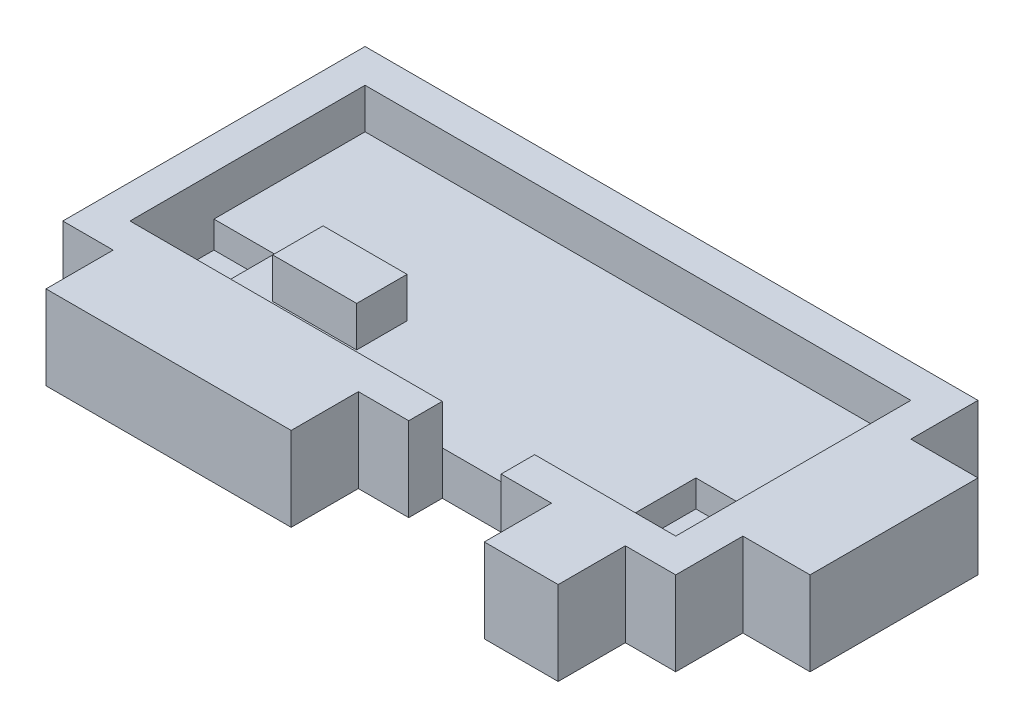
ISO-10303-21;
HEADER;
FILE_DESCRIPTION(('STEP AP214'),'2;1');
FILE_NAME('part.step','',(''),(''),'','','');
FILE_SCHEMA(('AUTOMOTIVE_DESIGN { 1 0 10303 214 1 1 1 1 }'));
ENDSEC;
DATA;
#1=APPLICATION_CONTEXT('core data for automotive mechanical design processes');
#2=APPLICATION_PROTOCOL_DEFINITION('international standard','automotive_design',2000,#1);
#3=PRODUCT_CONTEXT('',#1,'mechanical');
#4=PRODUCT('Part','Part','',(#3));
#5=PRODUCT_RELATED_PRODUCT_CATEGORY('part','',(#4));
#6=PRODUCT_DEFINITION_FORMATION('','',#4);
#7=PRODUCT_DEFINITION_CONTEXT('part definition',#1,'design');
#8=PRODUCT_DEFINITION('design','',#6,#7);
#9=PRODUCT_DEFINITION_SHAPE('','',#8);
#10=(LENGTH_UNIT() NAMED_UNIT(*) SI_UNIT(.MILLI.,.METRE.));
#11=(NAMED_UNIT(*) PLANE_ANGLE_UNIT() SI_UNIT($,.RADIAN.));
#12=(NAMED_UNIT(*) SI_UNIT($,.STERADIAN.) SOLID_ANGLE_UNIT());
#13=UNCERTAINTY_MEASURE_WITH_UNIT(LENGTH_MEASURE(1.E-05),#10,'distance_accuracy_value','');
#14=(GEOMETRIC_REPRESENTATION_CONTEXT(3) GLOBAL_UNCERTAINTY_ASSIGNED_CONTEXT((#13)) GLOBAL_UNIT_ASSIGNED_CONTEXT((#10,
#11,#12)) REPRESENTATION_CONTEXT('',''));
#15=CARTESIAN_POINT('',(0.,0.,0.));
#16=DIRECTION('',(0.,0.,1.));
#17=DIRECTION('',(1.,0.,0.));
#18=AXIS2_PLACEMENT_3D('',#15,#16,#17);
#19=CARTESIAN_POINT('',(36.5,-5.,0.));
#20=DIRECTION('',(1.,0.,0.));
#21=DIRECTION('',(0.,0.,-1.));
#22=AXIS2_PLACEMENT_3D('',#19,#20,#21);
#23=PLANE('',#22);
#24=DIRECTION('',(0.,-1.,0.));
#25=VECTOR('',#24,1.);
#26=CARTESIAN_POINT('',(36.5,0.,-4.));
#27=LINE('',#26,#25);
#28=CARTESIAN_POINT('',(36.5,0.,-4.));
#29=VERTEX_POINT('',#28);
#30=CARTESIAN_POINT('',(36.5,-5.,-4.));
#31=VERTEX_POINT('',#30);
#32=EDGE_CURVE('E297',#29,#31,#27,.T.);
#33=ORIENTED_EDGE('',*,*,#32,.F.);
#34=DIRECTION('',(0.,0.,-1.));
#35=VECTOR('',#34,1.);
#36=CARTESIAN_POINT('',(36.5,0.,0.));
#37=LINE('',#36,#35);
#38=CARTESIAN_POINT('',(36.5,0.,0.));
#39=VERTEX_POINT('',#38);
#40=EDGE_CURVE('E590',#39,#29,#37,.T.);
#41=ORIENTED_EDGE('',*,*,#40,.F.);
#42=DIRECTION('',(0.,1.,0.));
#43=VECTOR('',#42,1.);
#44=CARTESIAN_POINT('',(36.5,-5.,0.));
#45=LINE('',#44,#43);
#46=CARTESIAN_POINT('',(36.5,-5.,0.));
#47=VERTEX_POINT('',#46);
#48=EDGE_CURVE('E603',#47,#39,#45,.T.);
#49=ORIENTED_EDGE('',*,*,#48,.F.);
#50=DIRECTION('',(0.,0.,-1.));
#51=VECTOR('',#50,1.);
#52=CARTESIAN_POINT('',(36.5,-5.,0.));
#53=LINE('',#52,#51);
#54=EDGE_CURVE('E68',#47,#31,#53,.T.);
#55=ORIENTED_EDGE('',*,*,#54,.T.);
#56=EDGE_LOOP('',(#33,#41,#49,#55));
#57=FACE_BOUND('',#56,.T.);
#58=ADVANCED_FACE('F44',(#57),#23,.T.);
#59=CARTESIAN_POINT('',(0.,-5.,0.));
#60=DIRECTION('',(0.,0.,1.));
#61=DIRECTION('',(1.,0.,0.));
#62=AXIS2_PLACEMENT_3D('',#59,#60,#61);
#63=PLANE('',#62);
#64=DIRECTION('',(1.,0.,0.));
#65=VECTOR('',#64,1.);
#66=CARTESIAN_POINT('',(0.,-5.,0.));
#67=LINE('',#66,#65);
#68=CARTESIAN_POINT('',(26.1,-5.,0.));
#69=VERTEX_POINT('',#68);
#70=CARTESIAN_POINT('',(29.1,-5.,0.));
#71=VERTEX_POINT('',#70);
#72=EDGE_CURVE('E571',#69,#71,#67,.T.);
#73=ORIENTED_EDGE('',*,*,#72,.T.);
#74=DIRECTION('',(0.,-1.,0.));
#75=VECTOR('',#74,1.);
#76=CARTESIAN_POINT('',(29.1,0.,0.));
#77=LINE('',#76,#75);
#78=CARTESIAN_POINT('',(29.1,0.,0.));
#79=VERTEX_POINT('',#78);
#80=EDGE_CURVE('E322',#79,#71,#77,.T.);
#81=ORIENTED_EDGE('',*,*,#80,.F.);
#82=DIRECTION('',(1.,0.,0.));
#83=VECTOR('',#82,1.);
#84=CARTESIAN_POINT('',(0.,0.,0.));
#85=LINE('',#84,#83);
#86=CARTESIAN_POINT('',(26.1,0.,0.));
#87=VERTEX_POINT('',#86);
#88=EDGE_CURVE('E589',#87,#79,#85,.T.);
#89=ORIENTED_EDGE('',*,*,#88,.F.);
#90=DIRECTION('',(0.,-1.,0.));
#91=VECTOR('',#90,1.);
#92=CARTESIAN_POINT('',(26.1,0.,0.));
#93=LINE('',#92,#91);
#94=EDGE_CURVE('E441',#87,#69,#93,.T.);
#95=ORIENTED_EDGE('',*,*,#94,.T.);
#96=EDGE_LOOP('',(#73,#81,#89,#95));
#97=FACE_BOUND('',#96,.T.);
#98=ADVANCED_FACE('F681',(#97),#63,.T.);
#99=CARTESIAN_POINT('',(33.5,0.,0.));
#100=VERTEX_POINT('',#99);
#101=EDGE_CURVE('E582',#100,#39,#85,.T.);
#102=ORIENTED_EDGE('',*,*,#101,.F.);
#103=DIRECTION('',(0.,1.,0.));
#104=VECTOR('',#103,1.);
#105=CARTESIAN_POINT('',(33.5,0.,0.));
#106=LINE('',#105,#104);
#107=CARTESIAN_POINT('',(33.5,-5.,0.));
#108=VERTEX_POINT('',#107);
#109=EDGE_CURVE('E318',#108,#100,#106,.T.);
#110=ORIENTED_EDGE('',*,*,#109,.F.);
#111=EDGE_CURVE('E563',#108,#47,#67,.T.);
#112=ORIENTED_EDGE('',*,*,#111,.T.);
#113=ORIENTED_EDGE('',*,*,#48,.T.);
#114=EDGE_LOOP('',(#102,#110,#112,#113));
#115=FACE_BOUND('',#114,.T.);
#116=ADVANCED_FACE('F654',(#115),#63,.T.);
#117=CARTESIAN_POINT('',(0.,-5.,0.));
#118=VERTEX_POINT('',#117);
#119=CARTESIAN_POINT('',(3.,-5.,0.));
#120=VERTEX_POINT('',#119);
#121=EDGE_CURVE('E565',#118,#120,#67,.T.);
#122=ORIENTED_EDGE('',*,*,#121,.T.);
#123=DIRECTION('',(0.,-1.,0.));
#124=VECTOR('',#123,1.);
#125=CARTESIAN_POINT('',(3.,0.,0.));
#126=LINE('',#125,#124);
#127=CARTESIAN_POINT('',(3.,0.,0.));
#128=VERTEX_POINT('',#127);
#129=EDGE_CURVE('E327',#128,#120,#126,.T.);
#130=ORIENTED_EDGE('',*,*,#129,.F.);
#131=CARTESIAN_POINT('',(0.,0.,0.));
#132=VERTEX_POINT('',#131);
#133=EDGE_CURVE('E583',#132,#128,#85,.T.);
#134=ORIENTED_EDGE('',*,*,#133,.F.);
#135=DIRECTION('',(0.,1.,0.));
#136=VECTOR('',#135,1.);
#137=CARTESIAN_POINT('',(0.,-5.,0.));
#138=LINE('',#137,#136);
#139=EDGE_CURVE('E578',#118,#132,#138,.T.);
#140=ORIENTED_EDGE('',*,*,#139,.F.);
#141=EDGE_LOOP('',(#122,#130,#134,#140));
#142=FACE_BOUND('',#141,.T.);
#143=ADVANCED_FACE('F614',(#142),#63,.T.);
#144=CARTESIAN_POINT('',(17.6,0.,0.));
#145=VERTEX_POINT('',#144);
#146=CARTESIAN_POINT('',(20.6,0.,0.));
#147=VERTEX_POINT('',#146);
#148=EDGE_CURVE('E588',#145,#147,#85,.T.);
#149=ORIENTED_EDGE('',*,*,#148,.F.);
#150=DIRECTION('',(0.,1.,0.));
#151=VECTOR('',#150,1.);
#152=CARTESIAN_POINT('',(17.6,0.,0.));
#153=LINE('',#152,#151);
#154=CARTESIAN_POINT('',(17.6,-5.,0.));
#155=VERTEX_POINT('',#154);
#156=EDGE_CURVE('E344',#155,#145,#153,.T.);
#157=ORIENTED_EDGE('',*,*,#156,.F.);
#158=CARTESIAN_POINT('',(20.6,-5.,0.));
#159=VERTEX_POINT('',#158);
#160=EDGE_CURVE('E570',#155,#159,#67,.T.);
#161=ORIENTED_EDGE('',*,*,#160,.T.);
#162=DIRECTION('',(0.,1.,0.));
#163=VECTOR('',#162,1.);
#164=CARTESIAN_POINT('',(20.6,0.,0.));
#165=LINE('',#164,#163);
#166=EDGE_CURVE('E401',#159,#147,#165,.T.);
#167=ORIENTED_EDGE('',*,*,#166,.T.);
#168=EDGE_LOOP('',(#149,#157,#161,#167));
#169=FACE_BOUND('',#168,.T.);
#170=ADVANCED_FACE('F641',(#169),#63,.T.);
#171=CARTESIAN_POINT('',(2.,-2.4,-2.));
#172=DIRECTION('',(0.,0.,1.));
#173=DIRECTION('',(1.,0.,0.));
#174=AXIS2_PLACEMENT_3D('',#171,#172,#173);
#175=PLANE('',#174);
#176=DIRECTION('',(1.,0.,0.));
#177=VECTOR('',#176,1.);
#178=CARTESIAN_POINT('',(2.,-2.4,-2.));
#179=LINE('',#178,#177);
#180=CARTESIAN_POINT('',(26.1,-2.4,-2.));
#181=VERTEX_POINT('',#180);
#182=CARTESIAN_POINT('',(29.7,-2.4,-2.));
#183=VERTEX_POINT('',#182);
#184=EDGE_CURVE('E517',#181,#183,#179,.T.);
#185=ORIENTED_EDGE('',*,*,#184,.F.);
#186=DIRECTION('',(0.,-1.,0.));
#187=VECTOR('',#186,1.);
#188=CARTESIAN_POINT('',(26.1,0.,-2.));
#189=LINE('',#188,#187);
#190=CARTESIAN_POINT('',(26.1,0.,-2.));
#191=VERTEX_POINT('',#190);
#192=EDGE_CURVE('E446',#191,#181,#189,.T.);
#193=ORIENTED_EDGE('',*,*,#192,.F.);
#194=DIRECTION('',(1.,0.,0.));
#195=VECTOR('',#194,1.);
#196=CARTESIAN_POINT('',(2.,0.,-2.));
#197=LINE('',#196,#195);
#198=CARTESIAN_POINT('',(34.5,0.,-2.));
#199=VERTEX_POINT('',#198);
#200=EDGE_CURVE('E533',#191,#199,#197,.T.);
#201=ORIENTED_EDGE('',*,*,#200,.T.);
#202=DIRECTION('',(0.,1.,0.));
#203=VECTOR('',#202,1.);
#204=CARTESIAN_POINT('',(34.5,-2.4,-2.));
#205=LINE('',#204,#203);
#206=CARTESIAN_POINT('',(34.5,-4.,-2.));
#207=VERTEX_POINT('',#206);
#208=EDGE_CURVE('E552',#207,#199,#205,.T.);
#209=ORIENTED_EDGE('',*,*,#208,.F.);
#210=DIRECTION('',(1.,0.,0.));
#211=VECTOR('',#210,1.);
#212=CARTESIAN_POINT('',(34.5,-4.,-2.));
#213=LINE('',#212,#211);
#214=CARTESIAN_POINT('',(29.7,-4.,-2.));
#215=VERTEX_POINT('',#214);
#216=EDGE_CURVE('E410',#215,#207,#213,.T.);
#217=ORIENTED_EDGE('',*,*,#216,.F.);
#218=DIRECTION('',(0.,1.,0.));
#219=VECTOR('',#218,1.);
#220=CARTESIAN_POINT('',(29.7,-4.,-2.));
#221=LINE('',#220,#219);
#222=EDGE_CURVE('E371',#215,#183,#221,.T.);
#223=ORIENTED_EDGE('',*,*,#222,.T.);
#224=EDGE_LOOP('',(#185,#193,#201,#209,#217,#223));
#225=FACE_BOUND('',#224,.T.);
#226=ADVANCED_FACE('F715',(#225),#175,.F.);
#227=CARTESIAN_POINT('',(0.,-2.4,0.));
#228=DIRECTION('',(0.,1.,0.));
#229=DIRECTION('',(0.,0.,1.));
#230=AXIS2_PLACEMENT_3D('',#227,#228,#229);
#231=PLANE('',#230);
#232=DIRECTION('',(-1.,0.,0.));
#233=VECTOR('',#232,1.);
#234=CARTESIAN_POINT('',(2.,-2.4,-7.));
#235=LINE('',#234,#233);
#236=CARTESIAN_POINT('',(5.6,-2.4,-7.));
#237=VERTEX_POINT('',#236);
#238=CARTESIAN_POINT('',(2.,-2.4,-7.));
#239=VERTEX_POINT('',#238);
#240=EDGE_CURVE('E377',#237,#239,#235,.T.);
#241=ORIENTED_EDGE('',*,*,#240,.F.);
#242=DIRECTION('',(0.,0.,-1.));
#243=VECTOR('',#242,1.);
#244=CARTESIAN_POINT('',(5.6,-2.4,-7.));
#245=LINE('',#244,#243);
#246=CARTESIAN_POINT('',(5.6,-2.4,-2.));
#247=VERTEX_POINT('',#246);
#248=EDGE_CURVE('E390',#247,#237,#245,.T.);
#249=ORIENTED_EDGE('',*,*,#248,.F.);
#250=CARTESIAN_POINT('',(20.6,-2.4,-2.));
#251=VERTEX_POINT('',#250);
#252=EDGE_CURVE('E519',#247,#251,#179,.T.);
#253=ORIENTED_EDGE('',*,*,#252,.T.);
#254=EDGE_CURVE('E523',#251,#181,#179,.T.);
#255=ORIENTED_EDGE('',*,*,#254,.T.);
#256=ORIENTED_EDGE('',*,*,#184,.T.);
#257=DIRECTION('',(0.,0.,1.));
#258=VECTOR('',#257,1.);
#259=CARTESIAN_POINT('',(29.7,-2.4,-2.));
#260=LINE('',#259,#258);
#261=CARTESIAN_POINT('',(29.7,-2.4,-8.));
#262=VERTEX_POINT('',#261);
#263=EDGE_CURVE('E416',#262,#183,#260,.T.);
#264=ORIENTED_EDGE('',*,*,#263,.F.);
#265=DIRECTION('',(-1.,0.,0.));
#266=VECTOR('',#265,1.);
#267=CARTESIAN_POINT('',(34.5,-2.4,-8.));
#268=LINE('',#267,#266);
#269=CARTESIAN_POINT('',(34.5,-2.4,-8.));
#270=VERTEX_POINT('',#269);
#271=EDGE_CURVE('E394',#270,#262,#268,.T.);
#272=ORIENTED_EDGE('',*,*,#271,.F.);
#273=DIRECTION('',(0.,0.,-1.));
#274=VECTOR('',#273,1.);
#275=CARTESIAN_POINT('',(34.5,-2.4,-16.));
#276=LINE('',#275,#274);
#277=CARTESIAN_POINT('',(34.5,-2.4,-16.));
#278=VERTEX_POINT('',#277);
#279=EDGE_CURVE('E522',#270,#278,#276,.T.);
#280=ORIENTED_EDGE('',*,*,#279,.T.);
#281=DIRECTION('',(-1.,0.,0.));
#282=VECTOR('',#281,1.);
#283=CARTESIAN_POINT('',(2.,-2.4,-16.));
#284=LINE('',#283,#282);
#285=CARTESIAN_POINT('',(2.,-2.4,-16.));
#286=VERTEX_POINT('',#285);
#287=EDGE_CURVE('E526',#278,#286,#284,.T.);
#288=ORIENTED_EDGE('',*,*,#287,.T.);
#289=DIRECTION('',(0.,0.,1.));
#290=VECTOR('',#289,1.);
#291=CARTESIAN_POINT('',(2.,-2.4,-16.));
#292=LINE('',#291,#290);
#293=EDGE_CURVE('E513',#286,#239,#292,.T.);
#294=ORIENTED_EDGE('',*,*,#293,.T.);
#295=EDGE_LOOP('',(#241,#249,#253,#255,#256,#264,#272,#280,#288,#294));
#296=FACE_BOUND('',#295,.T.);
#297=DIRECTION('',(1.,0.,0.));
#298=VECTOR('',#297,1.);
#299=CARTESIAN_POINT('',(8.,-2.4,-4.5));
#300=LINE('',#299,#298);
#301=CARTESIAN_POINT('',(8.,-2.4,-4.5));
#302=VERTEX_POINT('',#301);
#303=CARTESIAN_POINT('',(13.,-2.4,-4.5));
#304=VERTEX_POINT('',#303);
#305=EDGE_CURVE('E490',#302,#304,#300,.T.);
#306=ORIENTED_EDGE('',*,*,#305,.F.);
#307=DIRECTION('',(0.,0.,1.));
#308=VECTOR('',#307,1.);
#309=CARTESIAN_POINT('',(8.,-2.4,-7.5));
#310=LINE('',#309,#308);
#311=CARTESIAN_POINT('',(8.,-2.4,-7.5));
#312=VERTEX_POINT('',#311);
#313=EDGE_CURVE('E462',#312,#302,#310,.T.);
#314=ORIENTED_EDGE('',*,*,#313,.F.);
#315=DIRECTION('',(-1.,0.,0.));
#316=VECTOR('',#315,1.);
#317=CARTESIAN_POINT('',(8.,-2.4,-7.5));
#318=LINE('',#317,#316);
#319=CARTESIAN_POINT('',(13.,-2.4,-7.5));
#320=VERTEX_POINT('',#319);
#321=EDGE_CURVE('E477',#320,#312,#318,.T.);
#322=ORIENTED_EDGE('',*,*,#321,.F.);
#323=DIRECTION('',(0.,0.,-1.));
#324=VECTOR('',#323,1.);
#325=CARTESIAN_POINT('',(13.,-2.4,-7.5));
#326=LINE('',#325,#324);
#327=EDGE_CURVE('E493',#304,#320,#326,.T.);
#328=ORIENTED_EDGE('',*,*,#327,.F.);
#329=EDGE_LOOP('',(#306,#314,#322,#328));
#330=FACE_BOUND('',#329,.T.);
#331=ADVANCED_FACE('F700',(#296,#330),#231,.T.);
#332=CARTESIAN_POINT('',(0.,-5.,0.));
#333=DIRECTION('',(-1.,0.,0.));
#334=DIRECTION('',(0.,0.,1.));
#335=AXIS2_PLACEMENT_3D('',#332,#333,#334);
#336=PLANE('',#335);
#337=DIRECTION('',(0.,0.,1.));
#338=VECTOR('',#337,1.);
#339=CARTESIAN_POINT('',(0.,0.,0.));
#340=LINE('',#339,#338);
#341=CARTESIAN_POINT('',(0.,0.,-18.));
#342=VERTEX_POINT('',#341);
#343=EDGE_CURVE('E548',#342,#132,#340,.T.);
#344=ORIENTED_EDGE('',*,*,#343,.F.);
#345=DIRECTION('',(0.,1.,0.));
#346=VECTOR('',#345,1.);
#347=CARTESIAN_POINT('',(0.,-5.,-18.));
#348=LINE('',#347,#346);
#349=CARTESIAN_POINT('',(0.,-5.,-18.));
#350=VERTEX_POINT('',#349);
#351=EDGE_CURVE('E53',#350,#342,#348,.T.);
#352=ORIENTED_EDGE('',*,*,#351,.F.);
#353=DIRECTION('',(0.,0.,1.));
#354=VECTOR('',#353,1.);
#355=CARTESIAN_POINT('',(0.,-5.,0.));
#356=LINE('',#355,#354);
#357=EDGE_CURVE('E559',#350,#118,#356,.T.);
#358=ORIENTED_EDGE('',*,*,#357,.T.);
#359=ORIENTED_EDGE('',*,*,#139,.T.);
#360=EDGE_LOOP('',(#344,#352,#358,#359));
#361=FACE_BOUND('',#360,.T.);
#362=ADVANCED_FACE('F46',(#361),#336,.T.);
#363=CARTESIAN_POINT('',(0.,-5.,-18.));
#364=DIRECTION('',(0.,0.,-1.));
#365=DIRECTION('',(-1.,0.,0.));
#366=AXIS2_PLACEMENT_3D('',#363,#364,#365);
#367=PLANE('',#366);
#368=DIRECTION('',(-1.,0.,0.));
#369=VECTOR('',#368,1.);
#370=CARTESIAN_POINT('',(0.,0.,-18.));
#371=LINE('',#370,#369);
#372=CARTESIAN_POINT('',(36.5,0.,-18.));
#373=VERTEX_POINT('',#372);
#374=EDGE_CURVE('E564',#373,#342,#371,.T.);
#375=ORIENTED_EDGE('',*,*,#374,.F.);
#376=DIRECTION('',(0.,1.,0.));
#377=VECTOR('',#376,1.);
#378=CARTESIAN_POINT('',(36.5,-5.,-18.));
#379=LINE('',#378,#377);
#380=CARTESIAN_POINT('',(36.5,-5.,-18.));
#381=VERTEX_POINT('',#380);
#382=EDGE_CURVE('E599',#381,#373,#379,.T.);
#383=ORIENTED_EDGE('',*,*,#382,.F.);
#384=DIRECTION('',(-1.,0.,0.));
#385=VECTOR('',#384,1.);
#386=CARTESIAN_POINT('',(0.,-5.,-18.));
#387=LINE('',#386,#385);
#388=EDGE_CURVE('E574',#381,#350,#387,.T.);
#389=ORIENTED_EDGE('',*,*,#388,.T.);
#390=ORIENTED_EDGE('',*,*,#351,.T.);
#391=EDGE_LOOP('',(#375,#383,#389,#390));
#392=FACE_BOUND('',#391,.T.);
#393=ADVANCED_FACE('F623',(#392),#367,.T.);
#394=DIRECTION('',(0.,1.,0.));
#395=VECTOR('',#394,1.);
#396=CARTESIAN_POINT('',(36.5,0.,-14.));
#397=LINE('',#396,#395);
#398=CARTESIAN_POINT('',(36.5,-5.,-14.));
#399=VERTEX_POINT('',#398);
#400=CARTESIAN_POINT('',(36.5,0.,-14.));
#401=VERTEX_POINT('',#400);
#402=EDGE_CURVE('E60',#399,#401,#397,.T.);
#403=ORIENTED_EDGE('',*,*,#402,.F.);
#404=EDGE_CURVE('E569',#399,#381,#53,.T.);
#405=ORIENTED_EDGE('',*,*,#404,.T.);
#406=ORIENTED_EDGE('',*,*,#382,.T.);
#407=EDGE_CURVE('E587',#401,#373,#37,.T.);
#408=ORIENTED_EDGE('',*,*,#407,.F.);
#409=EDGE_LOOP('',(#403,#405,#406,#408));
#410=FACE_BOUND('',#409,.T.);
#411=ADVANCED_FACE('F683',(#410),#23,.T.);
#412=CARTESIAN_POINT('',(0.,-5.,0.));
#413=DIRECTION('',(0.,-1.,0.));
#414=DIRECTION('',(0.,0.,-1.));
#415=AXIS2_PLACEMENT_3D('',#412,#413,#414);
#416=PLANE('',#415);
#417=DIRECTION('',(0.,0.,-1.));
#418=VECTOR('',#417,1.);
#419=CARTESIAN_POINT('',(26.1,-5.,0.00100000000000013));
#420=LINE('',#419,#418);
#421=CARTESIAN_POINT('',(26.1,-5.,-2.));
#422=VERTEX_POINT('',#421);
#423=EDGE_CURVE('E458',#69,#422,#420,.T.);
#424=ORIENTED_EDGE('',*,*,#423,.T.);
#425=DIRECTION('',(-1.,0.,0.));
#426=VECTOR('',#425,1.);
#427=CARTESIAN_POINT('',(26.1,-5.,-2.));
#428=LINE('',#427,#426);
#429=CARTESIAN_POINT('',(20.6,-5.,-2.));
#430=VERTEX_POINT('',#429);
#431=EDGE_CURVE('E450',#422,#430,#428,.T.);
#432=ORIENTED_EDGE('',*,*,#431,.T.);
#433=DIRECTION('',(0.,0.,-1.));
#434=VECTOR('',#433,1.);
#435=CARTESIAN_POINT('',(20.6,-5.,0.00100000000000013));
#436=LINE('',#435,#434);
#437=EDGE_CURVE('E467',#159,#430,#436,.T.);
#438=ORIENTED_EDGE('',*,*,#437,.F.);
#439=ORIENTED_EDGE('',*,*,#160,.F.);
#440=DIRECTION('',(0.,0.,-1.));
#441=VECTOR('',#440,1.);
#442=CARTESIAN_POINT('',(17.6,-5.,4.));
#443=LINE('',#442,#441);
#444=CARTESIAN_POINT('',(17.6,-5.,4.));
#445=VERTEX_POINT('',#444);
#446=EDGE_CURVE('E365',#445,#155,#443,.T.);
#447=ORIENTED_EDGE('',*,*,#446,.F.);
#448=DIRECTION('',(1.,0.,0.));
#449=VECTOR('',#448,1.);
#450=CARTESIAN_POINT('',(3.,-5.,4.));
#451=LINE('',#450,#449);
#452=CARTESIAN_POINT('',(3.,-5.,4.));
#453=VERTEX_POINT('',#452);
#454=EDGE_CURVE('E343',#453,#445,#451,.T.);
#455=ORIENTED_EDGE('',*,*,#454,.F.);
#456=DIRECTION('',(0.,0.,-1.));
#457=VECTOR('',#456,1.);
#458=CARTESIAN_POINT('',(3.,-5.,4.));
#459=LINE('',#458,#457);
#460=EDGE_CURVE('E368',#453,#120,#459,.T.);
#461=ORIENTED_EDGE('',*,*,#460,.T.);
#462=ORIENTED_EDGE('',*,*,#121,.F.);
#463=ORIENTED_EDGE('',*,*,#357,.F.);
#464=ORIENTED_EDGE('',*,*,#388,.F.);
#465=ORIENTED_EDGE('',*,*,#404,.F.);
#466=DIRECTION('',(-1.,0.,0.));
#467=VECTOR('',#466,1.);
#468=CARTESIAN_POINT('',(40.5,-5.,-14.));
#469=LINE('',#468,#467);
#470=CARTESIAN_POINT('',(40.5,-5.,-14.));
#471=VERTEX_POINT('',#470);
#472=EDGE_CURVE('E280',#471,#399,#469,.T.);
#473=ORIENTED_EDGE('',*,*,#472,.F.);
#474=DIRECTION('',(0.,0.,-1.));
#475=VECTOR('',#474,1.);
#476=CARTESIAN_POINT('',(40.5,-5.,-4.));
#477=LINE('',#476,#475);
#478=CARTESIAN_POINT('',(40.5,-5.,-4.));
#479=VERTEX_POINT('',#478);
#480=EDGE_CURVE('E272',#479,#471,#477,.T.);
#481=ORIENTED_EDGE('',*,*,#480,.F.);
#482=DIRECTION('',(-1.,0.,0.));
#483=VECTOR('',#482,1.);
#484=CARTESIAN_POINT('',(40.5,-5.,-4.));
#485=LINE('',#484,#483);
#486=EDGE_CURVE('E277',#479,#31,#485,.T.);
#487=ORIENTED_EDGE('',*,*,#486,.T.);
#488=ORIENTED_EDGE('',*,*,#54,.F.);
#489=ORIENTED_EDGE('',*,*,#111,.F.);
#490=DIRECTION('',(0.,0.,-1.));
#491=VECTOR('',#490,1.);
#492=CARTESIAN_POINT('',(33.5,-5.,4.));
#493=LINE('',#492,#491);
#494=CARTESIAN_POINT('',(33.5,-5.,4.));
#495=VERTEX_POINT('',#494);
#496=EDGE_CURVE('E303',#495,#108,#493,.T.);
#497=ORIENTED_EDGE('',*,*,#496,.F.);
#498=DIRECTION('',(1.,0.,0.));
#499=VECTOR('',#498,1.);
#500=CARTESIAN_POINT('',(29.1,-5.,4.));
#501=LINE('',#500,#499);
#502=CARTESIAN_POINT('',(29.1,-5.,4.));
#503=VERTEX_POINT('',#502);
#504=EDGE_CURVE('E333',#503,#495,#501,.T.);
#505=ORIENTED_EDGE('',*,*,#504,.F.);
#506=DIRECTION('',(0.,0.,-1.));
#507=VECTOR('',#506,1.);
#508=CARTESIAN_POINT('',(29.1,-5.,4.));
#509=LINE('',#508,#507);
#510=EDGE_CURVE('E299',#503,#71,#509,.T.);
#511=ORIENTED_EDGE('',*,*,#510,.T.);
#512=ORIENTED_EDGE('',*,*,#72,.F.);
#513=EDGE_LOOP('',(#424,#432,#438,#439,#447,#455,#461,#462,#463,#464,#465,#473,#481,#487,#488,
#489,#497,#505,#511,#512));
#514=FACE_BOUND('',#513,.T.);
#515=ADVANCED_FACE('F275',(#514),#416,.T.);
#516=CARTESIAN_POINT('',(0.,0.,0.));
#517=DIRECTION('',(0.,-1.,0.));
#518=DIRECTION('',(0.,0.,-1.));
#519=AXIS2_PLACEMENT_3D('',#516,#517,#518);
#520=PLANE('',#519);
#521=ORIENTED_EDGE('',*,*,#200,.F.);
#522=DIRECTION('',(0.,0.,-1.));
#523=VECTOR('',#522,1.);
#524=CARTESIAN_POINT('',(26.1,0.,0.00100000000000013));
#525=LINE('',#524,#523);
#526=EDGE_CURVE('E459',#87,#191,#525,.T.);
#527=ORIENTED_EDGE('',*,*,#526,.F.);
#528=ORIENTED_EDGE('',*,*,#88,.T.);
#529=DIRECTION('',(0.,0.,-1.));
#530=VECTOR('',#529,1.);
#531=CARTESIAN_POINT('',(29.1,0.,4.));
#532=LINE('',#531,#530);
#533=CARTESIAN_POINT('',(29.1,0.,4.));
#534=VERTEX_POINT('',#533);
#535=EDGE_CURVE('E314',#534,#79,#532,.T.);
#536=ORIENTED_EDGE('',*,*,#535,.F.);
#537=DIRECTION('',(-1.,0.,0.));
#538=VECTOR('',#537,1.);
#539=CARTESIAN_POINT('',(29.1,0.,4.));
#540=LINE('',#539,#538);
#541=CARTESIAN_POINT('',(33.5,0.,4.));
#542=VERTEX_POINT('',#541);
#543=EDGE_CURVE('E317',#542,#534,#540,.T.);
#544=ORIENTED_EDGE('',*,*,#543,.F.);
#545=DIRECTION('',(0.,0.,-1.));
#546=VECTOR('',#545,1.);
#547=CARTESIAN_POINT('',(33.5,0.,4.));
#548=LINE('',#547,#546);
#549=EDGE_CURVE('E311',#542,#100,#548,.T.);
#550=ORIENTED_EDGE('',*,*,#549,.T.);
#551=ORIENTED_EDGE('',*,*,#101,.T.);
#552=ORIENTED_EDGE('',*,*,#40,.T.);
#553=DIRECTION('',(-1.,0.,0.));
#554=VECTOR('',#553,1.);
#555=CARTESIAN_POINT('',(40.5,0.,-4.));
#556=LINE('',#555,#554);
#557=CARTESIAN_POINT('',(40.5,0.,-4.));
#558=VERTEX_POINT('',#557);
#559=EDGE_CURVE('E663',#558,#29,#556,.T.);
#560=ORIENTED_EDGE('',*,*,#559,.F.);
#561=DIRECTION('',(0.,0.,1.));
#562=VECTOR('',#561,1.);
#563=CARTESIAN_POINT('',(40.5,0.,-4.));
#564=LINE('',#563,#562);
#565=CARTESIAN_POINT('',(40.5,0.,-14.));
#566=VERTEX_POINT('',#565);
#567=EDGE_CURVE('E290',#566,#558,#564,.T.);
#568=ORIENTED_EDGE('',*,*,#567,.F.);
#569=DIRECTION('',(-1.,0.,0.));
#570=VECTOR('',#569,1.);
#571=CARTESIAN_POINT('',(40.5,0.,-14.));
#572=LINE('',#571,#570);
#573=EDGE_CURVE('E305',#566,#401,#572,.T.);
#574=ORIENTED_EDGE('',*,*,#573,.T.);
#575=ORIENTED_EDGE('',*,*,#407,.T.);
#576=ORIENTED_EDGE('',*,*,#374,.T.);
#577=ORIENTED_EDGE('',*,*,#343,.T.);
#578=ORIENTED_EDGE('',*,*,#133,.T.);
#579=DIRECTION('',(0.,0.,-1.));
#580=VECTOR('',#579,1.);
#581=CARTESIAN_POINT('',(3.,0.,4.));
#582=LINE('',#581,#580);
#583=CARTESIAN_POINT('',(3.,0.,4.));
#584=VERTEX_POINT('',#583);
#585=EDGE_CURVE('E353',#584,#128,#582,.T.);
#586=ORIENTED_EDGE('',*,*,#585,.F.);
#587=DIRECTION('',(-1.,0.,0.));
#588=VECTOR('',#587,1.);
#589=CARTESIAN_POINT('',(3.,0.,4.));
#590=LINE('',#589,#588);
#591=CARTESIAN_POINT('',(17.6,0.,4.));
#592=VERTEX_POINT('',#591);
#593=EDGE_CURVE('E350',#592,#584,#590,.T.);
#594=ORIENTED_EDGE('',*,*,#593,.F.);
#595=DIRECTION('',(0.,0.,-1.));
#596=VECTOR('',#595,1.);
#597=CARTESIAN_POINT('',(17.6,0.,4.));
#598=LINE('',#597,#596);
#599=EDGE_CURVE('E362',#592,#145,#598,.T.);
#600=ORIENTED_EDGE('',*,*,#599,.T.);
#601=ORIENTED_EDGE('',*,*,#148,.T.);
#602=DIRECTION('',(0.,0.,-1.));
#603=VECTOR('',#602,1.);
#604=CARTESIAN_POINT('',(20.6,0.,0.00100000000000013));
#605=LINE('',#604,#603);
#606=CARTESIAN_POINT('',(20.6,0.,-2.));
#607=VERTEX_POINT('',#606);
#608=EDGE_CURVE('E463',#147,#607,#605,.T.);
#609=ORIENTED_EDGE('',*,*,#608,.T.);
#610=CARTESIAN_POINT('',(2.,0.,-2.));
#611=VERTEX_POINT('',#610);
#612=EDGE_CURVE('E534',#611,#607,#197,.T.);
#613=ORIENTED_EDGE('',*,*,#612,.F.);
#614=DIRECTION('',(0.,0.,1.));
#615=VECTOR('',#614,1.);
#616=CARTESIAN_POINT('',(2.,0.,-16.));
#617=LINE('',#616,#615);
#618=CARTESIAN_POINT('',(2.,0.,-16.));
#619=VERTEX_POINT('',#618);
#620=EDGE_CURVE('E512',#619,#611,#617,.T.);
#621=ORIENTED_EDGE('',*,*,#620,.F.);
#622=DIRECTION('',(-1.,0.,0.));
#623=VECTOR('',#622,1.);
#624=CARTESIAN_POINT('',(2.,0.,-16.));
#625=LINE('',#624,#623);
#626=CARTESIAN_POINT('',(34.5,0.,-16.));
#627=VERTEX_POINT('',#626);
#628=EDGE_CURVE('E518',#627,#619,#625,.T.);
#629=ORIENTED_EDGE('',*,*,#628,.F.);
#630=DIRECTION('',(0.,0.,-1.));
#631=VECTOR('',#630,1.);
#632=CARTESIAN_POINT('',(34.5,0.,-16.));
#633=LINE('',#632,#631);
#634=EDGE_CURVE('E538',#199,#627,#633,.T.);
#635=ORIENTED_EDGE('',*,*,#634,.F.);
#636=EDGE_LOOP('',(#521,#527,#528,#536,#544,#550,#551,#552,#560,#568,#574,#575,#576,#577,#578,
#586,#594,#600,#601,#609,#613,#621,#629,#635));
#637=FACE_BOUND('',#636,.T.);
#638=ADVANCED_FACE('F618',(#637),#520,.F.);
#639=CARTESIAN_POINT('',(2.,-2.4,-16.));
#640=DIRECTION('',(-1.,0.,0.));
#641=DIRECTION('',(0.,0.,1.));
#642=AXIS2_PLACEMENT_3D('',#639,#640,#641);
#643=PLANE('',#642);
#644=ORIENTED_EDGE('',*,*,#620,.T.);
#645=DIRECTION('',(0.,1.,0.));
#646=VECTOR('',#645,1.);
#647=CARTESIAN_POINT('',(2.,-2.4,-2.));
#648=LINE('',#647,#646);
#649=CARTESIAN_POINT('',(2.,-4.,-2.));
#650=VERTEX_POINT('',#649);
#651=EDGE_CURVE('E530',#650,#611,#648,.T.);
#652=ORIENTED_EDGE('',*,*,#651,.F.);
#653=DIRECTION('',(0.,0.,1.));
#654=VECTOR('',#653,1.);
#655=CARTESIAN_POINT('',(2.,-4.,-7.));
#656=LINE('',#655,#654);
#657=CARTESIAN_POINT('',(2.,-4.,-7.));
#658=VERTEX_POINT('',#657);
#659=EDGE_CURVE('E372',#658,#650,#656,.T.);
#660=ORIENTED_EDGE('',*,*,#659,.F.);
#661=DIRECTION('',(0.,1.,0.));
#662=VECTOR('',#661,1.);
#663=CARTESIAN_POINT('',(2.,-4.,-7.));
#664=LINE('',#663,#662);
#665=EDGE_CURVE('E398',#658,#239,#664,.T.);
#666=ORIENTED_EDGE('',*,*,#665,.T.);
#667=ORIENTED_EDGE('',*,*,#293,.F.);
#668=DIRECTION('',(0.,1.,0.));
#669=VECTOR('',#668,1.);
#670=CARTESIAN_POINT('',(2.,-2.4,-16.));
#671=LINE('',#670,#669);
#672=EDGE_CURVE('E545',#286,#619,#671,.T.);
#673=ORIENTED_EDGE('',*,*,#672,.T.);
#674=EDGE_LOOP('',(#644,#652,#660,#666,#667,#673));
#675=FACE_BOUND('',#674,.T.);
#676=ADVANCED_FACE('F703',(#675),#643,.F.);
#677=CARTESIAN_POINT('',(2.,-2.4,-16.));
#678=DIRECTION('',(0.,0.,-1.));
#679=DIRECTION('',(-1.,0.,0.));
#680=AXIS2_PLACEMENT_3D('',#677,#678,#679);
#681=PLANE('',#680);
#682=ORIENTED_EDGE('',*,*,#628,.T.);
#683=ORIENTED_EDGE('',*,*,#672,.F.);
#684=ORIENTED_EDGE('',*,*,#287,.F.);
#685=DIRECTION('',(0.,1.,0.));
#686=VECTOR('',#685,1.);
#687=CARTESIAN_POINT('',(34.5,-2.4,-16.));
#688=LINE('',#687,#686);
#689=EDGE_CURVE('E549',#278,#627,#688,.T.);
#690=ORIENTED_EDGE('',*,*,#689,.T.);
#691=EDGE_LOOP('',(#682,#683,#684,#690));
#692=FACE_BOUND('',#691,.T.);
#693=ADVANCED_FACE('F707',(#692),#681,.F.);
#694=CARTESIAN_POINT('',(34.5,-2.4,-16.));
#695=DIRECTION('',(1.,0.,0.));
#696=DIRECTION('',(0.,0.,-1.));
#697=AXIS2_PLACEMENT_3D('',#694,#695,#696);
#698=PLANE('',#697);
#699=ORIENTED_EDGE('',*,*,#634,.T.);
#700=ORIENTED_EDGE('',*,*,#689,.F.);
#701=ORIENTED_EDGE('',*,*,#279,.F.);
#702=DIRECTION('',(0.,1.,0.));
#703=VECTOR('',#702,1.);
#704=CARTESIAN_POINT('',(34.5,-4.,-8.));
#705=LINE('',#704,#703);
#706=CARTESIAN_POINT('',(34.5,-4.,-8.));
#707=VERTEX_POINT('',#706);
#708=EDGE_CURVE('E407',#707,#270,#705,.T.);
#709=ORIENTED_EDGE('',*,*,#708,.F.);
#710=DIRECTION('',(0.,0.,-1.));
#711=VECTOR('',#710,1.);
#712=CARTESIAN_POINT('',(34.5,-4.,-2.));
#713=LINE('',#712,#711);
#714=EDGE_CURVE('E420',#207,#707,#713,.T.);
#715=ORIENTED_EDGE('',*,*,#714,.F.);
#716=ORIENTED_EDGE('',*,*,#208,.T.);
#717=EDGE_LOOP('',(#699,#700,#701,#709,#715,#716));
#718=FACE_BOUND('',#717,.T.);
#719=ADVANCED_FACE('F713',(#718),#698,.F.);
#720=ORIENTED_EDGE('',*,*,#612,.T.);
#721=DIRECTION('',(0.,-1.,0.));
#722=VECTOR('',#721,1.);
#723=CARTESIAN_POINT('',(20.6,-2.4,-2.));
#724=LINE('',#723,#722);
#725=EDGE_CURVE('E11',#607,#251,#724,.T.);
#726=ORIENTED_EDGE('',*,*,#725,.T.);
#727=ORIENTED_EDGE('',*,*,#252,.F.);
#728=DIRECTION('',(0.,1.,0.));
#729=VECTOR('',#728,1.);
#730=CARTESIAN_POINT('',(5.6,-4.,-2.));
#731=LINE('',#730,#729);
#732=CARTESIAN_POINT('',(5.6,-4.,-2.));
#733=VERTEX_POINT('',#732);
#734=EDGE_CURVE('E389',#733,#247,#731,.T.);
#735=ORIENTED_EDGE('',*,*,#734,.F.);
#736=DIRECTION('',(1.,0.,0.));
#737=VECTOR('',#736,1.);
#738=CARTESIAN_POINT('',(2.,-4.,-2.));
#739=LINE('',#738,#737);
#740=EDGE_CURVE('E376',#650,#733,#739,.T.);
#741=ORIENTED_EDGE('',*,*,#740,.F.);
#742=ORIENTED_EDGE('',*,*,#651,.T.);
#743=EDGE_LOOP('',(#720,#726,#727,#735,#741,#742));
#744=FACE_BOUND('',#743,.T.);
#745=ADVANCED_FACE('F709',(#744),#175,.F.);
#746=CARTESIAN_POINT('',(8.,0.,-7.5));
#747=DIRECTION('',(1.,0.,0.));
#748=DIRECTION('',(0.,0.,-1.));
#749=AXIS2_PLACEMENT_3D('',#746,#747,#748);
#750=PLANE('',#749);
#751=ORIENTED_EDGE('',*,*,#313,.T.);
#752=DIRECTION('',(0.,-1.,0.));
#753=VECTOR('',#752,1.);
#754=CARTESIAN_POINT('',(8.,0.,-4.5));
#755=LINE('',#754,#753);
#756=CARTESIAN_POINT('',(8.,0.,-4.5));
#757=VERTEX_POINT('',#756);
#758=EDGE_CURVE('E509',#757,#302,#755,.T.);
#759=ORIENTED_EDGE('',*,*,#758,.F.);
#760=DIRECTION('',(0.,0.,1.));
#761=VECTOR('',#760,1.);
#762=CARTESIAN_POINT('',(8.,0.,-7.5));
#763=LINE('',#762,#761);
#764=CARTESIAN_POINT('',(8.,0.,-7.5));
#765=VERTEX_POINT('',#764);
#766=EDGE_CURVE('E472',#765,#757,#763,.T.);
#767=ORIENTED_EDGE('',*,*,#766,.F.);
#768=DIRECTION('',(0.,-1.,0.));
#769=VECTOR('',#768,1.);
#770=CARTESIAN_POINT('',(8.,0.,-7.5));
#771=LINE('',#770,#769);
#772=EDGE_CURVE('E486',#765,#312,#771,.T.);
#773=ORIENTED_EDGE('',*,*,#772,.T.);
#774=EDGE_LOOP('',(#751,#759,#767,#773));
#775=FACE_BOUND('',#774,.T.);
#776=ADVANCED_FACE('F712',(#775),#750,.F.);
#777=CARTESIAN_POINT('',(8.,0.,-4.5));
#778=DIRECTION('',(0.,0.,-1.));
#779=DIRECTION('',(-1.,0.,0.));
#780=AXIS2_PLACEMENT_3D('',#777,#778,#779);
#781=PLANE('',#780);
#782=ORIENTED_EDGE('',*,*,#305,.T.);
#783=DIRECTION('',(0.,-1.,0.));
#784=VECTOR('',#783,1.);
#785=CARTESIAN_POINT('',(13.,0.,-4.5));
#786=LINE('',#785,#784);
#787=CARTESIAN_POINT('',(13.,0.,-4.5));
#788=VERTEX_POINT('',#787);
#789=EDGE_CURVE('E505',#788,#304,#786,.T.);
#790=ORIENTED_EDGE('',*,*,#789,.F.);
#791=DIRECTION('',(1.,0.,0.));
#792=VECTOR('',#791,1.);
#793=CARTESIAN_POINT('',(8.,0.,-4.5));
#794=LINE('',#793,#792);
#795=EDGE_CURVE('E476',#757,#788,#794,.T.);
#796=ORIENTED_EDGE('',*,*,#795,.F.);
#797=ORIENTED_EDGE('',*,*,#758,.T.);
#798=EDGE_LOOP('',(#782,#790,#796,#797));
#799=FACE_BOUND('',#798,.T.);
#800=ADVANCED_FACE('F726',(#799),#781,.F.);
#801=CARTESIAN_POINT('',(13.,0.,-7.5));
#802=DIRECTION('',(-1.,0.,0.));
#803=DIRECTION('',(0.,0.,1.));
#804=AXIS2_PLACEMENT_3D('',#801,#802,#803);
#805=PLANE('',#804);
#806=ORIENTED_EDGE('',*,*,#327,.T.);
#807=DIRECTION('',(0.,-1.,0.));
#808=VECTOR('',#807,1.);
#809=CARTESIAN_POINT('',(13.,0.,-7.5));
#810=LINE('',#809,#808);
#811=CARTESIAN_POINT('',(13.,0.,-7.5));
#812=VERTEX_POINT('',#811);
#813=EDGE_CURVE('E502',#812,#320,#810,.T.);
#814=ORIENTED_EDGE('',*,*,#813,.F.);
#815=DIRECTION('',(0.,0.,-1.));
#816=VECTOR('',#815,1.);
#817=CARTESIAN_POINT('',(13.,0.,-7.5));
#818=LINE('',#817,#816);
#819=EDGE_CURVE('E480',#788,#812,#818,.T.);
#820=ORIENTED_EDGE('',*,*,#819,.F.);
#821=ORIENTED_EDGE('',*,*,#789,.T.);
#822=EDGE_LOOP('',(#806,#814,#820,#821));
#823=FACE_BOUND('',#822,.T.);
#824=ADVANCED_FACE('F730',(#823),#805,.F.);
#825=CARTESIAN_POINT('',(8.,0.,-7.5));
#826=DIRECTION('',(0.,0.,1.));
#827=DIRECTION('',(1.,0.,0.));
#828=AXIS2_PLACEMENT_3D('',#825,#826,#827);
#829=PLANE('',#828);
#830=ORIENTED_EDGE('',*,*,#321,.T.);
#831=ORIENTED_EDGE('',*,*,#772,.F.);
#832=DIRECTION('',(-1.,0.,0.));
#833=VECTOR('',#832,1.);
#834=CARTESIAN_POINT('',(8.,0.,-7.5));
#835=LINE('',#834,#833);
#836=EDGE_CURVE('E483',#812,#765,#835,.T.);
#837=ORIENTED_EDGE('',*,*,#836,.F.);
#838=ORIENTED_EDGE('',*,*,#813,.T.);
#839=EDGE_LOOP('',(#830,#831,#837,#838));
#840=FACE_BOUND('',#839,.T.);
#841=ADVANCED_FACE('F734',(#840),#829,.F.);
#842=CARTESIAN_POINT('',(0.,0.,0.));
#843=DIRECTION('',(0.,1.,0.));
#844=DIRECTION('',(0.,0.,1.));
#845=AXIS2_PLACEMENT_3D('',#842,#843,#844);
#846=PLANE('',#845);
#847=ORIENTED_EDGE('',*,*,#766,.T.);
#848=ORIENTED_EDGE('',*,*,#795,.T.);
#849=ORIENTED_EDGE('',*,*,#819,.T.);
#850=ORIENTED_EDGE('',*,*,#836,.T.);
#851=EDGE_LOOP('',(#847,#848,#849,#850));
#852=FACE_BOUND('',#851,.T.);
#853=ADVANCED_FACE('F738',(#852),#846,.T.);
#854=CARTESIAN_POINT('',(26.1,0.,0.00100000000000013));
#855=DIRECTION('',(1.,0.,0.));
#856=DIRECTION('',(0.,0.,-1.));
#857=AXIS2_PLACEMENT_3D('',#854,#855,#856);
#858=PLANE('',#857);
#859=ORIENTED_EDGE('',*,*,#526,.T.);
#860=ORIENTED_EDGE('',*,*,#192,.T.);
#861=EDGE_CURVE('E445',#181,#422,#189,.T.);
#862=ORIENTED_EDGE('',*,*,#861,.T.);
#863=ORIENTED_EDGE('',*,*,#423,.F.);
#864=ORIENTED_EDGE('',*,*,#94,.F.);
#865=EDGE_LOOP('',(#859,#860,#862,#863,#864));
#866=FACE_BOUND('',#865,.T.);
#867=ADVANCED_FACE('F742',(#866),#858,.F.);
#868=CARTESIAN_POINT('',(20.6,0.,0.00100000000000013));
#869=DIRECTION('',(-1.,0.,0.));
#870=DIRECTION('',(0.,0.,1.));
#871=AXIS2_PLACEMENT_3D('',#868,#869,#870);
#872=PLANE('',#871);
#873=ORIENTED_EDGE('',*,*,#437,.T.);
#874=DIRECTION('',(0.,1.,0.));
#875=VECTOR('',#874,1.);
#876=CARTESIAN_POINT('',(20.6,0.,-2.));
#877=LINE('',#876,#875);
#878=EDGE_CURVE('E454',#430,#251,#877,.T.);
#879=ORIENTED_EDGE('',*,*,#878,.T.);
#880=ORIENTED_EDGE('',*,*,#725,.F.);
#881=ORIENTED_EDGE('',*,*,#608,.F.);
#882=ORIENTED_EDGE('',*,*,#166,.F.);
#883=EDGE_LOOP('',(#873,#879,#880,#881,#882));
#884=FACE_BOUND('',#883,.T.);
#885=ADVANCED_FACE('F746',(#884),#872,.F.);
#886=CARTESIAN_POINT('',(0.,0.,-2.));
#887=DIRECTION('',(0.,0.,-1.));
#888=DIRECTION('',(-1.,0.,0.));
#889=AXIS2_PLACEMENT_3D('',#886,#887,#888);
#890=PLANE('',#889);
#891=ORIENTED_EDGE('',*,*,#254,.F.);
#892=ORIENTED_EDGE('',*,*,#878,.F.);
#893=ORIENTED_EDGE('',*,*,#431,.F.);
#894=ORIENTED_EDGE('',*,*,#861,.F.);
#895=EDGE_LOOP('',(#891,#892,#893,#894));
#896=FACE_BOUND('',#895,.T.);
#897=ADVANCED_FACE('F750',(#896),#890,.F.);
#898=CARTESIAN_POINT('',(2.,-4.,-7.));
#899=DIRECTION('',(0.,0.,-1.));
#900=DIRECTION('',(-1.,0.,0.));
#901=AXIS2_PLACEMENT_3D('',#898,#899,#900);
#902=PLANE('',#901);
#903=ORIENTED_EDGE('',*,*,#240,.T.);
#904=ORIENTED_EDGE('',*,*,#665,.F.);
#905=DIRECTION('',(-1.,0.,0.));
#906=VECTOR('',#905,1.);
#907=CARTESIAN_POINT('',(2.,-4.,-7.));
#908=LINE('',#907,#906);
#909=CARTESIAN_POINT('',(5.6,-4.,-7.));
#910=VERTEX_POINT('',#909);
#911=EDGE_CURVE('E385',#910,#658,#908,.T.);
#912=ORIENTED_EDGE('',*,*,#911,.F.);
#913=DIRECTION('',(0.,1.,0.));
#914=VECTOR('',#913,1.);
#915=CARTESIAN_POINT('',(5.6,-4.,-7.));
#916=LINE('',#915,#914);
#917=EDGE_CURVE('E402',#910,#237,#916,.T.);
#918=ORIENTED_EDGE('',*,*,#917,.T.);
#919=EDGE_LOOP('',(#903,#904,#912,#918));
#920=FACE_BOUND('',#919,.T.);
#921=ADVANCED_FACE('F754',(#920),#902,.F.);
#922=CARTESIAN_POINT('',(5.6,-4.,-7.));
#923=DIRECTION('',(1.,0.,0.));
#924=DIRECTION('',(0.,0.,-1.));
#925=AXIS2_PLACEMENT_3D('',#922,#923,#924);
#926=PLANE('',#925);
#927=ORIENTED_EDGE('',*,*,#248,.T.);
#928=ORIENTED_EDGE('',*,*,#917,.F.);
#929=DIRECTION('',(0.,0.,-1.));
#930=VECTOR('',#929,1.);
#931=CARTESIAN_POINT('',(5.6,-4.,-7.));
#932=LINE('',#931,#930);
#933=EDGE_CURVE('E381',#733,#910,#932,.T.);
#934=ORIENTED_EDGE('',*,*,#933,.F.);
#935=ORIENTED_EDGE('',*,*,#734,.T.);
#936=EDGE_LOOP('',(#927,#928,#934,#935));
#937=FACE_BOUND('',#936,.T.);
#938=ADVANCED_FACE('F769',(#937),#926,.F.);
#939=CARTESIAN_POINT('',(0.,-4.,0.));
#940=DIRECTION('',(0.,1.,0.));
#941=DIRECTION('',(0.,0.,1.));
#942=AXIS2_PLACEMENT_3D('',#939,#940,#941);
#943=PLANE('',#942);
#944=ORIENTED_EDGE('',*,*,#659,.T.);
#945=ORIENTED_EDGE('',*,*,#740,.T.);
#946=ORIENTED_EDGE('',*,*,#933,.T.);
#947=ORIENTED_EDGE('',*,*,#911,.T.);
#948=EDGE_LOOP('',(#944,#945,#946,#947));
#949=FACE_BOUND('',#948,.T.);
#950=ADVANCED_FACE('F764',(#949),#943,.T.);
#951=CARTESIAN_POINT('',(29.7,-4.,-2.));
#952=DIRECTION('',(-1.,0.,0.));
#953=DIRECTION('',(0.,0.,1.));
#954=AXIS2_PLACEMENT_3D('',#951,#952,#953);
#955=PLANE('',#954);
#956=ORIENTED_EDGE('',*,*,#263,.T.);
#957=ORIENTED_EDGE('',*,*,#222,.F.);
#958=DIRECTION('',(0.,0.,1.));
#959=VECTOR('',#958,1.);
#960=CARTESIAN_POINT('',(29.7,-4.,-2.));
#961=LINE('',#960,#959);
#962=CARTESIAN_POINT('',(29.7,-4.,-8.));
#963=VERTEX_POINT('',#962);
#964=EDGE_CURVE('E427',#963,#215,#961,.T.);
#965=ORIENTED_EDGE('',*,*,#964,.F.);
#966=DIRECTION('',(0.,1.,0.));
#967=VECTOR('',#966,1.);
#968=CARTESIAN_POINT('',(29.7,-4.,-8.));
#969=LINE('',#968,#967);
#970=EDGE_CURVE('E411',#963,#262,#969,.T.);
#971=ORIENTED_EDGE('',*,*,#970,.T.);
#972=EDGE_LOOP('',(#956,#957,#965,#971));
#973=FACE_BOUND('',#972,.T.);
#974=ADVANCED_FACE('F761',(#973),#955,.F.);
#975=CARTESIAN_POINT('',(34.5,-4.,-8.));
#976=DIRECTION('',(0.,0.,-1.));
#977=DIRECTION('',(-1.,0.,0.));
#978=AXIS2_PLACEMENT_3D('',#975,#976,#977);
#979=PLANE('',#978);
#980=ORIENTED_EDGE('',*,*,#271,.T.);
#981=ORIENTED_EDGE('',*,*,#970,.F.);
#982=DIRECTION('',(-1.,0.,0.));
#983=VECTOR('',#982,1.);
#984=CARTESIAN_POINT('',(34.5,-4.,-8.));
#985=LINE('',#984,#983);
#986=EDGE_CURVE('E431',#707,#963,#985,.T.);
#987=ORIENTED_EDGE('',*,*,#986,.F.);
#988=ORIENTED_EDGE('',*,*,#708,.T.);
#989=EDGE_LOOP('',(#980,#981,#987,#988));
#990=FACE_BOUND('',#989,.T.);
#991=ADVANCED_FACE('F759',(#990),#979,.F.);
#992=CARTESIAN_POINT('',(0.,-4.,0.));
#993=DIRECTION('',(0.,1.,0.));
#994=DIRECTION('',(0.,0.,1.));
#995=AXIS2_PLACEMENT_3D('',#992,#993,#994);
#996=PLANE('',#995);
#997=ORIENTED_EDGE('',*,*,#714,.T.);
#998=ORIENTED_EDGE('',*,*,#986,.T.);
#999=ORIENTED_EDGE('',*,*,#964,.T.);
#1000=ORIENTED_EDGE('',*,*,#216,.T.);
#1001=EDGE_LOOP('',(#997,#998,#999,#1000));
#1002=FACE_BOUND('',#1001,.T.);
#1003=ADVANCED_FACE('F756',(#1002),#996,.T.);
#1004=CARTESIAN_POINT('',(3.,0.,4.));
#1005=DIRECTION('',(1.,0.,0.));
#1006=DIRECTION('',(0.,1.,0.));
#1007=AXIS2_PLACEMENT_3D('',#1004,#1005,#1006);
#1008=PLANE('',#1007);
#1009=ORIENTED_EDGE('',*,*,#129,.T.);
#1010=ORIENTED_EDGE('',*,*,#460,.F.);
#1011=DIRECTION('',(0.,-1.,0.));
#1012=VECTOR('',#1011,1.);
#1013=CARTESIAN_POINT('',(3.,0.,4.));
#1014=LINE('',#1013,#1012);
#1015=EDGE_CURVE('E339',#584,#453,#1014,.T.);
#1016=ORIENTED_EDGE('',*,*,#1015,.F.);
#1017=ORIENTED_EDGE('',*,*,#585,.T.);
#1018=EDGE_LOOP('',(#1009,#1010,#1016,#1017));
#1019=FACE_BOUND('',#1018,.T.);
#1020=ADVANCED_FACE('F629',(#1019),#1008,.F.);
#1021=CARTESIAN_POINT('',(17.6,0.,4.));
#1022=DIRECTION('',(-1.,0.,0.));
#1023=DIRECTION('',(0.,0.,1.));
#1024=AXIS2_PLACEMENT_3D('',#1021,#1022,#1023);
#1025=PLANE('',#1024);
#1026=ORIENTED_EDGE('',*,*,#156,.T.);
#1027=ORIENTED_EDGE('',*,*,#599,.F.);
#1028=DIRECTION('',(0.,1.,0.));
#1029=VECTOR('',#1028,1.);
#1030=CARTESIAN_POINT('',(17.6,0.,4.));
#1031=LINE('',#1030,#1029);
#1032=EDGE_CURVE('E347',#445,#592,#1031,.T.);
#1033=ORIENTED_EDGE('',*,*,#1032,.F.);
#1034=ORIENTED_EDGE('',*,*,#446,.T.);
#1035=EDGE_LOOP('',(#1026,#1027,#1033,#1034));
#1036=FACE_BOUND('',#1035,.T.);
#1037=ADVANCED_FACE('F636',(#1036),#1025,.F.);
#1038=CARTESIAN_POINT('',(0.,0.,4.));
#1039=DIRECTION('',(0.,0.,1.));
#1040=DIRECTION('',(1.,0.,0.));
#1041=AXIS2_PLACEMENT_3D('',#1038,#1039,#1040);
#1042=PLANE('',#1041);
#1043=ORIENTED_EDGE('',*,*,#1015,.T.);
#1044=ORIENTED_EDGE('',*,*,#454,.T.);
#1045=ORIENTED_EDGE('',*,*,#1032,.T.);
#1046=ORIENTED_EDGE('',*,*,#593,.T.);
#1047=EDGE_LOOP('',(#1043,#1044,#1045,#1046));
#1048=FACE_BOUND('',#1047,.T.);
#1049=ADVANCED_FACE('F633',(#1048),#1042,.T.);
#1050=CARTESIAN_POINT('',(29.1,0.,4.));
#1051=DIRECTION('',(1.,0.,0.));
#1052=DIRECTION('',(0.,0.,-1.));
#1053=AXIS2_PLACEMENT_3D('',#1050,#1051,#1052);
#1054=PLANE('',#1053);
#1055=ORIENTED_EDGE('',*,*,#80,.T.);
#1056=ORIENTED_EDGE('',*,*,#510,.F.);
#1057=DIRECTION('',(0.,-1.,0.));
#1058=VECTOR('',#1057,1.);
#1059=CARTESIAN_POINT('',(29.1,0.,4.));
#1060=LINE('',#1059,#1058);
#1061=EDGE_CURVE('E323',#534,#503,#1060,.T.);
#1062=ORIENTED_EDGE('',*,*,#1061,.F.);
#1063=ORIENTED_EDGE('',*,*,#535,.T.);
#1064=EDGE_LOOP('',(#1055,#1056,#1062,#1063));
#1065=FACE_BOUND('',#1064,.T.);
#1066=ADVANCED_FACE('F785',(#1065),#1054,.F.);
#1067=CARTESIAN_POINT('',(33.5,0.,4.));
#1068=DIRECTION('',(-1.,0.,0.));
#1069=DIRECTION('',(0.,0.,1.));
#1070=AXIS2_PLACEMENT_3D('',#1067,#1068,#1069);
#1071=PLANE('',#1070);
#1072=ORIENTED_EDGE('',*,*,#109,.T.);
#1073=ORIENTED_EDGE('',*,*,#549,.F.);
#1074=DIRECTION('',(0.,1.,0.));
#1075=VECTOR('',#1074,1.);
#1076=CARTESIAN_POINT('',(33.5,0.,4.));
#1077=LINE('',#1076,#1075);
#1078=EDGE_CURVE('E330',#495,#542,#1077,.T.);
#1079=ORIENTED_EDGE('',*,*,#1078,.F.);
#1080=ORIENTED_EDGE('',*,*,#496,.T.);
#1081=EDGE_LOOP('',(#1072,#1073,#1079,#1080));
#1082=FACE_BOUND('',#1081,.T.);
#1083=ADVANCED_FACE('F787',(#1082),#1071,.F.);
#1084=CARTESIAN_POINT('',(0.,0.,4.));
#1085=DIRECTION('',(0.,0.,1.));
#1086=DIRECTION('',(1.,0.,0.));
#1087=AXIS2_PLACEMENT_3D('',#1084,#1085,#1086);
#1088=PLANE('',#1087);
#1089=ORIENTED_EDGE('',*,*,#1061,.T.);
#1090=ORIENTED_EDGE('',*,*,#504,.T.);
#1091=ORIENTED_EDGE('',*,*,#1078,.T.);
#1092=ORIENTED_EDGE('',*,*,#543,.T.);
#1093=EDGE_LOOP('',(#1089,#1090,#1091,#1092));
#1094=FACE_BOUND('',#1093,.T.);
#1095=ADVANCED_FACE('F678',(#1094),#1088,.T.);
#1096=CARTESIAN_POINT('',(40.5,0.,-4.));
#1097=DIRECTION('',(0.,0.,-1.));
#1098=DIRECTION('',(0.,1.,0.));
#1099=AXIS2_PLACEMENT_3D('',#1096,#1097,#1098);
#1100=PLANE('',#1099);
#1101=ORIENTED_EDGE('',*,*,#32,.T.);
#1102=ORIENTED_EDGE('',*,*,#486,.F.);
#1103=DIRECTION('',(0.,-1.,0.));
#1104=VECTOR('',#1103,1.);
#1105=CARTESIAN_POINT('',(40.5,0.,-4.));
#1106=LINE('',#1105,#1104);
#1107=EDGE_CURVE('E285',#558,#479,#1106,.T.);
#1108=ORIENTED_EDGE('',*,*,#1107,.F.);
#1109=ORIENTED_EDGE('',*,*,#559,.T.);
#1110=EDGE_LOOP('',(#1101,#1102,#1108,#1109));
#1111=FACE_BOUND('',#1110,.T.);
#1112=ADVANCED_FACE('F296',(#1111),#1100,.F.);
#1113=CARTESIAN_POINT('',(40.5,0.,-14.));
#1114=DIRECTION('',(0.,0.,1.));
#1115=DIRECTION('',(1.,0.,0.));
#1116=AXIS2_PLACEMENT_3D('',#1113,#1114,#1115);
#1117=PLANE('',#1116);
#1118=ORIENTED_EDGE('',*,*,#402,.T.);
#1119=ORIENTED_EDGE('',*,*,#573,.F.);
#1120=DIRECTION('',(0.,1.,0.));
#1121=VECTOR('',#1120,1.);
#1122=CARTESIAN_POINT('',(40.5,0.,-14.));
#1123=LINE('',#1122,#1121);
#1124=EDGE_CURVE('E284',#471,#566,#1123,.T.);
#1125=ORIENTED_EDGE('',*,*,#1124,.F.);
#1126=ORIENTED_EDGE('',*,*,#472,.T.);
#1127=EDGE_LOOP('',(#1118,#1119,#1125,#1126));
#1128=FACE_BOUND('',#1127,.T.);
#1129=ADVANCED_FACE('F668',(#1128),#1117,.F.);
#1130=CARTESIAN_POINT('',(40.5,0.,0.));
#1131=DIRECTION('',(1.,0.,0.));
#1132=DIRECTION('',(0.,0.,-1.));
#1133=AXIS2_PLACEMENT_3D('',#1130,#1131,#1132);
#1134=PLANE('',#1133);
#1135=ORIENTED_EDGE('',*,*,#1107,.T.);
#1136=ORIENTED_EDGE('',*,*,#480,.T.);
#1137=ORIENTED_EDGE('',*,*,#1124,.T.);
#1138=ORIENTED_EDGE('',*,*,#567,.T.);
#1139=EDGE_LOOP('',(#1135,#1136,#1137,#1138));
#1140=FACE_BOUND('',#1139,.T.);
#1141=ADVANCED_FACE('F288',(#1140),#1134,.T.);
#1142=CLOSED_SHELL('',(#58,#98,#116,#143,#170,#226,#331,#362,#393,#411,#515,#638,#676,#693,#719,
#745,#776,#800,#824,#841,#853,#867,#885,#897,#921,#938,#950,#974,#991,#1003,#1020,#1037,#1049,
#1066,#1083,#1095,#1112,#1129,#1141));
#1143=MANIFOLD_SOLID_BREP('B2',#1142);
#1144=ADVANCED_BREP_SHAPE_REPRESENTATION('',(#18,#1143),#14);
#1145=SHAPE_DEFINITION_REPRESENTATION(#9,#1144);
ENDSEC;
END-ISO-10303-21;
